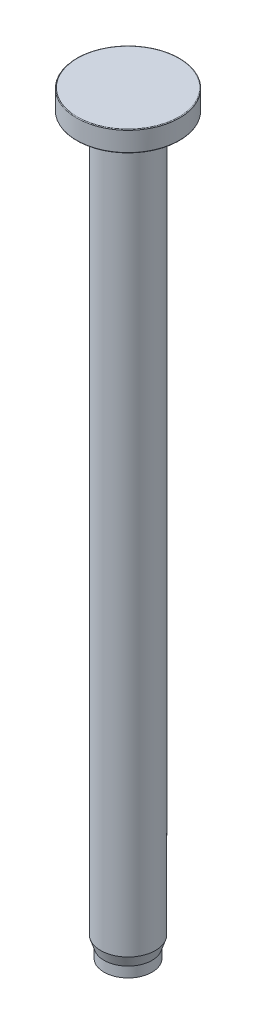
ISO-10303-21;
HEADER;
FILE_DESCRIPTION(('STEP AP214'),'2;1');
FILE_NAME('part.step','',(''),(''),'','','');
FILE_SCHEMA(('AUTOMOTIVE_DESIGN { 1 0 10303 214 1 1 1 1 }'));
ENDSEC;
DATA;
#1=APPLICATION_CONTEXT('core data for automotive mechanical design processes');
#2=APPLICATION_PROTOCOL_DEFINITION('international standard','automotive_design',2000,#1);
#3=PRODUCT_CONTEXT('',#1,'mechanical');
#4=PRODUCT('Part','Part','',(#3));
#5=PRODUCT_RELATED_PRODUCT_CATEGORY('part','',(#4));
#6=PRODUCT_DEFINITION_FORMATION('','',#4);
#7=PRODUCT_DEFINITION_CONTEXT('part definition',#1,'design');
#8=PRODUCT_DEFINITION('design','',#6,#7);
#9=PRODUCT_DEFINITION_SHAPE('','',#8);
#10=(LENGTH_UNIT() NAMED_UNIT(*) SI_UNIT(.MILLI.,.METRE.));
#11=(NAMED_UNIT(*) PLANE_ANGLE_UNIT() SI_UNIT($,.RADIAN.));
#12=(NAMED_UNIT(*) SI_UNIT($,.STERADIAN.) SOLID_ANGLE_UNIT());
#13=UNCERTAINTY_MEASURE_WITH_UNIT(LENGTH_MEASURE(1.E-05),#10,'distance_accuracy_value','');
#14=(GEOMETRIC_REPRESENTATION_CONTEXT(3) GLOBAL_UNCERTAINTY_ASSIGNED_CONTEXT((#13)) GLOBAL_UNIT_ASSIGNED_CONTEXT((#10,
#11,#12)) REPRESENTATION_CONTEXT('',''));
#15=CARTESIAN_POINT('',(0.,0.,0.));
#16=DIRECTION('',(0.,0.,1.));
#17=DIRECTION('',(1.,0.,0.));
#18=AXIS2_PLACEMENT_3D('',#15,#16,#17);
#19=CARTESIAN_POINT('',(0.,0.,0.));
#20=DIRECTION('',(0.,-1.,0.));
#21=DIRECTION('',(0.,0.,-1.));
#22=AXIS2_PLACEMENT_3D('',#19,#20,#21);
#23=PLANE('',#22);
#24=CARTESIAN_POINT('',(0.,0.,0.));
#25=DIRECTION('',(0.,-1.,0.));
#26=DIRECTION('',(0.,0.,-1.));
#27=AXIS2_PLACEMENT_3D('',#24,#25,#26);
#28=CIRCLE('',#27,7.4);
#29=CARTESIAN_POINT('',(0.,0.,-7.4));
#30=VERTEX_POINT('',#29);
#31=EDGE_CURVE('E10',#30,#30,#28,.T.);
#32=ORIENTED_EDGE('',*,*,#31,.T.);
#33=EDGE_LOOP('',(#32));
#34=FACE_BOUND('',#33,.T.);
#35=CARTESIAN_POINT('',(0.,0.,0.));
#36=DIRECTION('',(0.,-1.,0.));
#37=DIRECTION('',(1.,0.,0.));
#38=AXIS2_PLACEMENT_3D('',#35,#36,#37);
#39=CIRCLE('',#38,7.);
#40=CARTESIAN_POINT('',(7.,0.,0.));
#41=VERTEX_POINT('',#40);
#42=EDGE_CURVE('E50',#41,#41,#39,.T.);
#43=ORIENTED_EDGE('',*,*,#42,.F.);
#44=EDGE_LOOP('',(#43));
#45=FACE_BOUND('',#44,.T.);
#46=ADVANCED_FACE('F30',(#34,#45),#23,.T.);
#47=CARTESIAN_POINT('',(0.,0.,0.));
#48=DIRECTION('',(0.,-1.,0.));
#49=DIRECTION('',(0.,0.,-1.));
#50=AXIS2_PLACEMENT_3D('',#47,#48,#49);
#51=CYLINDRICAL_SURFACE('',#50,7.5);
#52=CARTESIAN_POINT('',(0.,2.9,0.));
#53=DIRECTION('',(0.,1.,0.));
#54=DIRECTION('',(0.,0.,1.));
#55=AXIS2_PLACEMENT_3D('',#52,#53,#54);
#56=CIRCLE('',#55,7.5);
#57=CARTESIAN_POINT('',(0.,2.9,7.5));
#58=VERTEX_POINT('',#57);
#59=EDGE_CURVE('E41',#58,#58,#56,.F.);
#60=ORIENTED_EDGE('',*,*,#59,.T.);
#61=EDGE_LOOP('',(#60));
#62=FACE_BOUND('',#61,.T.);
#63=CARTESIAN_POINT('',(0.,0.1,0.));
#64=DIRECTION('',(0.,-1.,0.));
#65=DIRECTION('',(0.,0.,-1.));
#66=AXIS2_PLACEMENT_3D('',#63,#64,#65);
#67=CIRCLE('',#66,7.5);
#68=CARTESIAN_POINT('',(0.,0.1,-7.5));
#69=VERTEX_POINT('',#68);
#70=EDGE_CURVE('E45',#69,#69,#67,.F.);
#71=ORIENTED_EDGE('',*,*,#70,.T.);
#72=EDGE_LOOP('',(#71));
#73=FACE_BOUND('',#72,.T.);
#74=ADVANCED_FACE('F95',(#62,#73),#51,.T.);
#75=CARTESIAN_POINT('',(7.5,3.,0.));
#76=DIRECTION('',(0.,1.,0.));
#77=DIRECTION('',(0.,0.,1.));
#78=AXIS2_PLACEMENT_3D('',#75,#76,#77);
#79=PLANE('',#78);
#80=CARTESIAN_POINT('',(0.,3.,0.));
#81=DIRECTION('',(0.,1.,0.));
#82=DIRECTION('',(0.,0.,1.));
#83=AXIS2_PLACEMENT_3D('',#80,#81,#82);
#84=CIRCLE('',#83,7.4);
#85=CARTESIAN_POINT('',(0.,3.,7.4));
#86=VERTEX_POINT('',#85);
#87=EDGE_CURVE('E37',#86,#86,#84,.T.);
#88=ORIENTED_EDGE('',*,*,#87,.T.);
#89=EDGE_LOOP('',(#88));
#90=FACE_BOUND('',#89,.T.);
#91=ADVANCED_FACE('F100',(#90),#79,.T.);
#92=CARTESIAN_POINT('',(0.,0.100000000000004,0.));
#93=DIRECTION('',(0.,-1.,0.));
#94=DIRECTION('',(1.,0.,0.));
#95=AXIS2_PLACEMENT_3D('',#92,#93,#94);
#96=TOROIDAL_SURFACE('',#95,7.,0.1);
#97=CARTESIAN_POINT('',(0.,0.0114958645324847,0.));
#98=DIRECTION('',(0.,-1.,0.));
#99=DIRECTION('',(1.,0.,0.));
#100=AXIS2_PLACEMENT_3D('',#97,#98,#99);
#101=CIRCLE('',#100,6.95344875935974);
#102=CARTESIAN_POINT('',(6.95344875935974,0.0114958645324807,0.));
#103=VERTEX_POINT('',#102);
#104=EDGE_CURVE('E53',#103,#103,#101,.T.);
#105=ORIENTED_EDGE('',*,*,#104,.F.);
#106=EDGE_LOOP('',(#105));
#107=FACE_BOUND('',#106,.T.);
#108=ORIENTED_EDGE('',*,*,#42,.T.);
#109=EDGE_LOOP('',(#108));
#110=FACE_BOUND('',#109,.T.);
#111=ADVANCED_FACE('F136',(#107,#110),#96,.T.);
#112=CARTESIAN_POINT('',(0.,0.0114958645324847,0.));
#113=DIRECTION('',(0.,-1.,0.));
#114=DIRECTION('',(1.,0.,0.));
#115=AXIS2_PLACEMENT_3D('',#112,#113,#114);
#116=CONICAL_SURFACE('',#115,6.95344875935974,1.08658284043977);
#117=CARTESIAN_POINT('',(0.,0.488504135467522,0.));
#118=DIRECTION('',(0.,-1.,0.));
#119=DIRECTION('',(1.,0.,0.));
#120=AXIS2_PLACEMENT_3D('',#117,#118,#119);
#121=CIRCLE('',#120,6.04655124064026);
#122=CARTESIAN_POINT('',(6.04655124064026,0.488504135467519,0.));
#123=VERTEX_POINT('',#122);
#124=EDGE_CURVE('E56',#123,#123,#121,.T.);
#125=ORIENTED_EDGE('',*,*,#124,.F.);
#126=EDGE_LOOP('',(#125));
#127=FACE_BOUND('',#126,.T.);
#128=ORIENTED_EDGE('',*,*,#104,.T.);
#129=EDGE_LOOP('',(#128));
#130=FACE_BOUND('',#129,.T.);
#131=ADVANCED_FACE('F198',(#127,#130),#116,.F.);
#132=CARTESIAN_POINT('',(0.,0.400000000000003,0.));
#133=DIRECTION('',(0.,-1.,0.));
#134=DIRECTION('',(1.,0.,0.));
#135=AXIS2_PLACEMENT_3D('',#132,#133,#134);
#136=TOROIDAL_SURFACE('',#135,6.,0.1);
#137=CARTESIAN_POINT('',(0.,0.500000000000003,0.));
#138=DIRECTION('',(0.,-1.,0.));
#139=DIRECTION('',(1.,0.,0.));
#140=AXIS2_PLACEMENT_3D('',#137,#138,#139);
#141=CIRCLE('',#140,6.);
#142=CARTESIAN_POINT('',(6.,0.499999999999999,0.));
#143=VERTEX_POINT('',#142);
#144=EDGE_CURVE('E59',#143,#143,#141,.T.);
#145=ORIENTED_EDGE('',*,*,#144,.F.);
#146=EDGE_LOOP('',(#145));
#147=FACE_BOUND('',#146,.T.);
#148=ORIENTED_EDGE('',*,*,#124,.T.);
#149=EDGE_LOOP('',(#148));
#150=FACE_BOUND('',#149,.T.);
#151=ADVANCED_FACE('F188',(#147,#150),#136,.F.);
#152=CARTESIAN_POINT('',(4.1,0.5,0.));
#153=DIRECTION('',(0.,1.,0.));
#154=DIRECTION('',(-1.,0.,0.));
#155=AXIS2_PLACEMENT_3D('',#152,#153,#154);
#156=PLANE('',#155);
#157=CARTESIAN_POINT('',(0.,0.500000000000002,0.));
#158=DIRECTION('',(0.,-1.,0.));
#159=DIRECTION('',(1.,0.,0.));
#160=AXIS2_PLACEMENT_3D('',#157,#158,#159);
#161=CIRCLE('',#160,4.1);
#162=CARTESIAN_POINT('',(4.1,0.5,0.));
#163=VERTEX_POINT('',#162);
#164=EDGE_CURVE('E62',#163,#163,#161,.T.);
#165=ORIENTED_EDGE('',*,*,#164,.F.);
#166=EDGE_LOOP('',(#165));
#167=FACE_BOUND('',#166,.T.);
#168=ORIENTED_EDGE('',*,*,#144,.T.);
#169=EDGE_LOOP('',(#168));
#170=FACE_BOUND('',#169,.T.);
#171=ADVANCED_FACE('F178',(#167,#170),#156,.F.);
#172=CARTESIAN_POINT('',(0.,0.400000000000002,0.));
#173=DIRECTION('',(0.,-1.,0.));
#174=DIRECTION('',(1.,0.,0.));
#175=AXIS2_PLACEMENT_3D('',#172,#173,#174);
#176=TOROIDAL_SURFACE('',#175,4.1,0.1);
#177=CARTESIAN_POINT('',(0.,0.400000000000002,0.));
#178=DIRECTION('',(0.,-1.,0.));
#179=DIRECTION('',(1.,0.,0.));
#180=AXIS2_PLACEMENT_3D('',#177,#178,#179);
#181=CIRCLE('',#180,4.);
#182=CARTESIAN_POINT('',(4.,0.399999999999999,0.));
#183=VERTEX_POINT('',#182);
#184=EDGE_CURVE('E65',#183,#183,#181,.T.);
#185=ORIENTED_EDGE('',*,*,#184,.F.);
#186=EDGE_LOOP('',(#185));
#187=FACE_BOUND('',#186,.T.);
#188=ORIENTED_EDGE('',*,*,#164,.T.);
#189=EDGE_LOOP('',(#188));
#190=FACE_BOUND('',#189,.T.);
#191=ADVANCED_FACE('F107',(#187,#190),#176,.F.);
#192=CARTESIAN_POINT('',(0.,-104.,0.));
#193=DIRECTION('',(0.,1.,0.));
#194=DIRECTION('',(0.,0.,1.));
#195=AXIS2_PLACEMENT_3D('',#192,#193,#194);
#196=CYLINDRICAL_SURFACE('',#195,4.);
#197=CARTESIAN_POINT('',(0.,-104.,0.));
#198=DIRECTION('',(0.,-1.,0.));
#199=DIRECTION('',(0.,0.,-1.));
#200=AXIS2_PLACEMENT_3D('',#197,#198,#199);
#201=CIRCLE('',#200,4.);
#202=CARTESIAN_POINT('',(0.,-104.,-4.));
#203=VERTEX_POINT('',#202);
#204=EDGE_CURVE('E68',#203,#203,#201,.T.);
#205=ORIENTED_EDGE('',*,*,#204,.F.);
#206=EDGE_LOOP('',(#205));
#207=FACE_BOUND('',#206,.T.);
#208=ORIENTED_EDGE('',*,*,#184,.T.);
#209=EDGE_LOOP('',(#208));
#210=FACE_BOUND('',#209,.T.);
#211=ADVANCED_FACE('F91',(#207,#210),#196,.T.);
#212=CARTESIAN_POINT('',(0.,-105.5,0.));
#213=DIRECTION('',(0.,1.,0.));
#214=DIRECTION('',(0.,0.,1.));
#215=AXIS2_PLACEMENT_3D('',#212,#213,#214);
#216=CONICAL_SURFACE('',#215,3.5,0.321750554396642);
#217=ORIENTED_EDGE('',*,*,#204,.T.);
#218=EDGE_LOOP('',(#217));
#219=FACE_BOUND('',#218,.T.);
#220=CARTESIAN_POINT('',(0.,-105.5,0.));
#221=DIRECTION('',(0.,-1.,0.));
#222=DIRECTION('',(0.,0.,-1.));
#223=AXIS2_PLACEMENT_3D('',#220,#221,#222);
#224=CIRCLE('',#223,3.5);
#225=CARTESIAN_POINT('',(0.,-105.5,-3.5));
#226=VERTEX_POINT('',#225);
#227=EDGE_CURVE('E71',#226,#226,#224,.T.);
#228=ORIENTED_EDGE('',*,*,#227,.F.);
#229=EDGE_LOOP('',(#228));
#230=FACE_BOUND('',#229,.T.);
#231=ADVANCED_FACE('F82',(#219,#230),#216,.T.);
#232=CARTESIAN_POINT('',(0.,-107.,0.));
#233=DIRECTION('',(0.,-1.,0.));
#234=DIRECTION('',(0.,0.,-1.));
#235=AXIS2_PLACEMENT_3D('',#232,#233,#234);
#236=CYLINDRICAL_SURFACE('',#235,3.5);
#237=ORIENTED_EDGE('',*,*,#227,.T.);
#238=EDGE_LOOP('',(#237));
#239=FACE_BOUND('',#238,.T.);
#240=CARTESIAN_POINT('',(0.,-107.,0.));
#241=DIRECTION('',(0.,-1.,0.));
#242=DIRECTION('',(0.,0.,-1.));
#243=AXIS2_PLACEMENT_3D('',#240,#241,#242);
#244=CIRCLE('',#243,3.5);
#245=CARTESIAN_POINT('',(0.,-107.,-3.5));
#246=VERTEX_POINT('',#245);
#247=EDGE_CURVE('E74',#246,#246,#244,.T.);
#248=ORIENTED_EDGE('',*,*,#247,.F.);
#249=EDGE_LOOP('',(#248));
#250=FACE_BOUND('',#249,.T.);
#251=ADVANCED_FACE('F80',(#239,#250),#236,.T.);
#252=CARTESIAN_POINT('',(3.5,-107.,0.));
#253=DIRECTION('',(0.,-1.,0.));
#254=DIRECTION('',(0.,0.,-1.));
#255=AXIS2_PLACEMENT_3D('',#252,#253,#254);
#256=PLANE('',#255);
#257=ORIENTED_EDGE('',*,*,#247,.T.);
#258=EDGE_LOOP('',(#257));
#259=FACE_BOUND('',#258,.T.);
#260=ADVANCED_FACE('F78',(#259),#256,.T.);
#261=CARTESIAN_POINT('',(0.,2.9,0.));
#262=DIRECTION('',(0.,1.,0.));
#263=DIRECTION('',(0.,0.,1.));
#264=AXIS2_PLACEMENT_3D('',#261,#262,#263);
#265=TOROIDAL_SURFACE('',#264,7.4,0.1);
#266=ORIENTED_EDGE('',*,*,#87,.F.);
#267=EDGE_LOOP('',(#266));
#268=FACE_BOUND('',#267,.T.);
#269=ORIENTED_EDGE('',*,*,#59,.F.);
#270=EDGE_LOOP('',(#269));
#271=FACE_BOUND('',#270,.T.);
#272=ADVANCED_FACE('F89',(#268,#271),#265,.T.);
#273=CARTESIAN_POINT('',(0.,0.1,0.));
#274=DIRECTION('',(0.,-1.,0.));
#275=DIRECTION('',(0.,0.,-1.));
#276=AXIS2_PLACEMENT_3D('',#273,#274,#275);
#277=TOROIDAL_SURFACE('',#276,7.4,0.1);
#278=ORIENTED_EDGE('',*,*,#70,.F.);
#279=EDGE_LOOP('',(#278));
#280=FACE_BOUND('',#279,.T.);
#281=ORIENTED_EDGE('',*,*,#31,.F.);
#282=EDGE_LOOP('',(#281));
#283=FACE_BOUND('',#282,.T.);
#284=ADVANCED_FACE('F32',(#280,#283),#277,.T.);
#285=CLOSED_SHELL('',(#46,#74,#91,#111,#131,#151,#171,#191,#211,#231,#251,#260,#272,#284));
#286=MANIFOLD_SOLID_BREP('B2',#285);
#287=ADVANCED_BREP_SHAPE_REPRESENTATION('',(#18,#286),#14);
#288=SHAPE_DEFINITION_REPRESENTATION(#9,#287);
ENDSEC;
END-ISO-10303-21;
